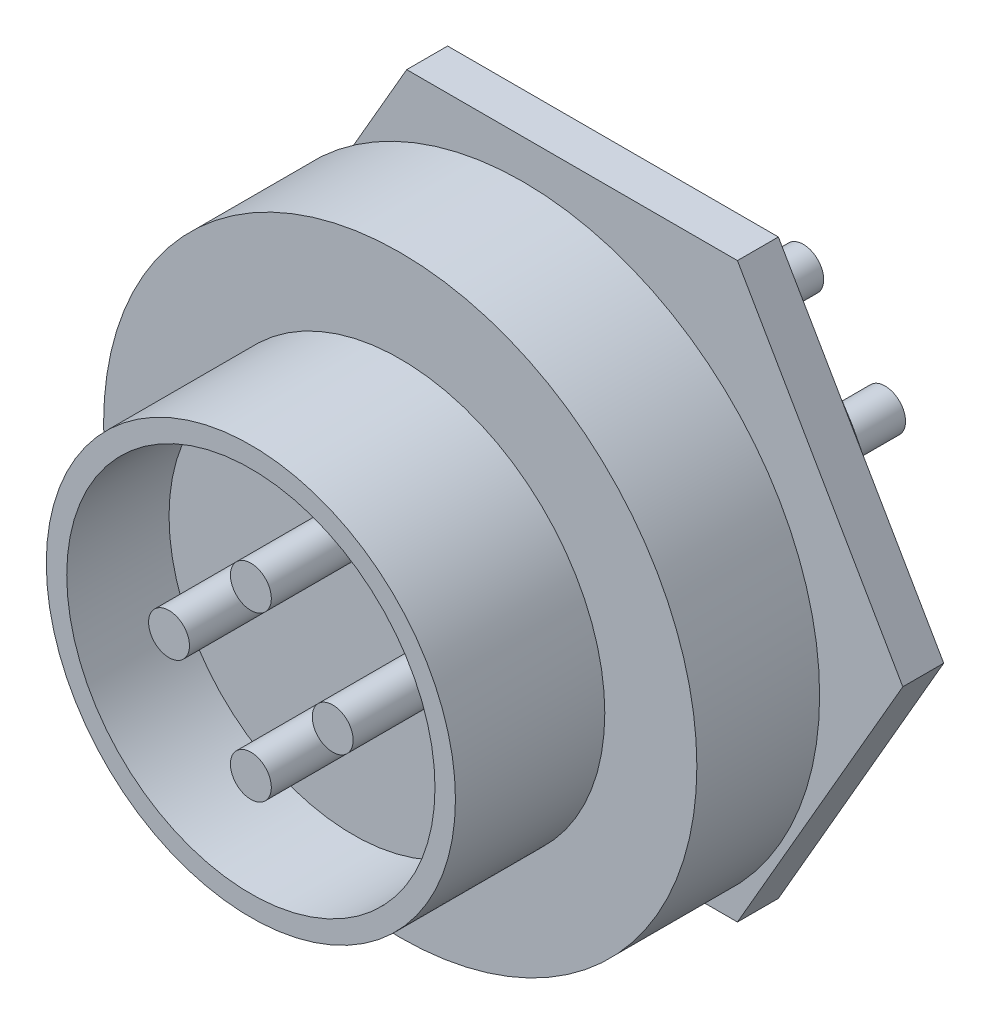
ISO-10303-21;
HEADER;
FILE_DESCRIPTION(('STEP AP214'),'2;1');
FILE_NAME('part.step','',(''),(''),'','','');
FILE_SCHEMA(('AUTOMOTIVE_DESIGN { 1 0 10303 214 1 1 1 1 }'));
ENDSEC;
DATA;
#1=APPLICATION_CONTEXT('core data for automotive mechanical design processes');
#2=APPLICATION_PROTOCOL_DEFINITION('international standard','automotive_design',2000,#1);
#3=PRODUCT_CONTEXT('',#1,'mechanical');
#4=PRODUCT('Part','Part','',(#3));
#5=PRODUCT_RELATED_PRODUCT_CATEGORY('part','',(#4));
#6=PRODUCT_DEFINITION_FORMATION('','',#4);
#7=PRODUCT_DEFINITION_CONTEXT('part definition',#1,'design');
#8=PRODUCT_DEFINITION('design','',#6,#7);
#9=PRODUCT_DEFINITION_SHAPE('','',#8);
#10=(LENGTH_UNIT() NAMED_UNIT(*) SI_UNIT(.MILLI.,.METRE.));
#11=(NAMED_UNIT(*) PLANE_ANGLE_UNIT() SI_UNIT($,.RADIAN.));
#12=(NAMED_UNIT(*) SI_UNIT($,.STERADIAN.) SOLID_ANGLE_UNIT());
#13=UNCERTAINTY_MEASURE_WITH_UNIT(LENGTH_MEASURE(1.E-05),#10,'distance_accuracy_value','');
#14=(GEOMETRIC_REPRESENTATION_CONTEXT(3) GLOBAL_UNCERTAINTY_ASSIGNED_CONTEXT((#13)) GLOBAL_UNIT_ASSIGNED_CONTEXT((#10,
#11,#12)) REPRESENTATION_CONTEXT('',''));
#15=CARTESIAN_POINT('',(0.,0.,0.));
#16=DIRECTION('',(0.,0.,1.));
#17=DIRECTION('',(1.,0.,0.));
#18=AXIS2_PLACEMENT_3D('',#15,#16,#17);
#19=CARTESIAN_POINT('',(0.,0.,2.4));
#20=DIRECTION('',(0.,0.,-1.));
#21=DIRECTION('',(-1.,0.,0.));
#22=AXIS2_PLACEMENT_3D('',#19,#20,#21);
#23=CYLINDRICAL_SURFACE('',#22,10.5);
#24=CARTESIAN_POINT('',(0.,0.,0.));
#25=DIRECTION('',(0.,0.,1.));
#26=DIRECTION('',(1.,0.,0.));
#27=AXIS2_PLACEMENT_3D('',#24,#25,#26);
#28=CIRCLE('',#27,10.5);
#29=CARTESIAN_POINT('',(-4.01995024844836,9.7,0.));
#30=VERTEX_POINT('',#29);
#31=CARTESIAN_POINT('',(4.01995024844836,9.7,0.));
#32=VERTEX_POINT('',#31);
#33=EDGE_CURVE('E167',#30,#32,#28,.T.);
#34=ORIENTED_EDGE('',*,*,#33,.T.);
#35=DIRECTION('',(0.,0.,-1.));
#36=VECTOR('',#35,1.);
#37=CARTESIAN_POINT('',(4.01995024844836,9.7,2.4));
#38=LINE('',#37,#36);
#39=CARTESIAN_POINT('',(4.01995024844836,9.7,2.4));
#40=VERTEX_POINT('',#39);
#41=EDGE_CURVE('E40',#40,#32,#38,.T.);
#42=ORIENTED_EDGE('',*,*,#41,.F.);
#43=CARTESIAN_POINT('',(0.,0.,2.4));
#44=DIRECTION('',(0.,0.,1.));
#45=DIRECTION('',(1.,0.,0.));
#46=AXIS2_PLACEMENT_3D('',#43,#44,#45);
#47=CIRCLE('',#46,10.5);
#48=CARTESIAN_POINT('',(-4.01995024844836,9.7,2.4));
#49=VERTEX_POINT('',#48);
#50=EDGE_CURVE('E170',#49,#40,#47,.T.);
#51=ORIENTED_EDGE('',*,*,#50,.F.);
#52=DIRECTION('',(0.,0.,-1.));
#53=VECTOR('',#52,1.);
#54=CARTESIAN_POINT('',(-4.01995024844836,9.7,2.4));
#55=LINE('',#54,#53);
#56=EDGE_CURVE('E175',#49,#30,#55,.T.);
#57=ORIENTED_EDGE('',*,*,#56,.T.);
#58=EDGE_LOOP('',(#34,#42,#51,#57));
#59=FACE_BOUND('',#58,.T.);
#60=ADVANCED_FACE('F37',(#59),#23,.T.);
#61=CARTESIAN_POINT('',(-4.01995024844836,9.7,2.4));
#62=DIRECTION('',(0.,-1.,0.));
#63=DIRECTION('',(0.,0.,-1.));
#64=AXIS2_PLACEMENT_3D('',#61,#62,#63);
#65=PLANE('',#64);
#66=DIRECTION('',(-1.,0.,0.));
#67=VECTOR('',#66,1.);
#68=CARTESIAN_POINT('',(-4.01995024844836,9.7,0.));
#69=LINE('',#68,#67);
#70=EDGE_CURVE('E173',#32,#30,#69,.T.);
#71=ORIENTED_EDGE('',*,*,#70,.T.);
#72=ORIENTED_EDGE('',*,*,#56,.F.);
#73=DIRECTION('',(-1.,0.,0.));
#74=VECTOR('',#73,1.);
#75=CARTESIAN_POINT('',(-4.01995024844836,9.7,2.4));
#76=LINE('',#75,#74);
#77=EDGE_CURVE('E52',#40,#49,#76,.T.);
#78=ORIENTED_EDGE('',*,*,#77,.F.);
#79=ORIENTED_EDGE('',*,*,#41,.T.);
#80=EDGE_LOOP('',(#71,#72,#78,#79));
#81=FACE_BOUND('',#80,.T.);
#82=ADVANCED_FACE('F181',(#81),#65,.F.);
#83=CARTESIAN_POINT('',(0.,0.,2.4));
#84=DIRECTION('',(0.,0.,1.));
#85=DIRECTION('',(1.,0.,0.));
#86=AXIS2_PLACEMENT_3D('',#83,#84,#85);
#87=PLANE('',#86);
#88=CARTESIAN_POINT('',(0.,0.,2.4));
#89=DIRECTION('',(0.,0.,1.));
#90=DIRECTION('',(1.,0.,0.));
#91=AXIS2_PLACEMENT_3D('',#88,#89,#90);
#92=CIRCLE('',#91,14.5);
#93=CARTESIAN_POINT('',(14.5,0.,2.4));
#94=VERTEX_POINT('',#93);
#95=EDGE_CURVE('E162',#94,#94,#92,.T.);
#96=ORIENTED_EDGE('',*,*,#95,.F.);
#97=EDGE_LOOP('',(#96));
#98=FACE_BOUND('',#97,.T.);
#99=ORIENTED_EDGE('',*,*,#77,.T.);
#100=ORIENTED_EDGE('',*,*,#50,.T.);
#101=EDGE_LOOP('',(#99,#100));
#102=FACE_BOUND('',#101,.T.);
#103=ADVANCED_FACE('F287',(#98,#102),#87,.F.);
#104=CARTESIAN_POINT('',(0.,0.,8.4));
#105=DIRECTION('',(0.,0.,-1.));
#106=DIRECTION('',(-1.,0.,0.));
#107=AXIS2_PLACEMENT_3D('',#104,#105,#106);
#108=CYLINDRICAL_SURFACE('',#107,14.5);
#109=CARTESIAN_POINT('',(0.,0.,8.4));
#110=DIRECTION('',(0.,0.,1.));
#111=DIRECTION('',(1.,0.,0.));
#112=AXIS2_PLACEMENT_3D('',#109,#110,#111);
#113=CIRCLE('',#112,14.5);
#114=CARTESIAN_POINT('',(14.5,0.,8.4));
#115=VERTEX_POINT('',#114);
#116=EDGE_CURVE('E164',#115,#115,#113,.T.);
#117=ORIENTED_EDGE('',*,*,#116,.F.);
#118=EDGE_LOOP('',(#117));
#119=FACE_BOUND('',#118,.T.);
#120=ORIENTED_EDGE('',*,*,#95,.T.);
#121=EDGE_LOOP('',(#120));
#122=FACE_BOUND('',#121,.T.);
#123=ADVANCED_FACE('F291',(#119,#122),#108,.T.);
#124=CARTESIAN_POINT('',(0.,0.,8.4));
#125=DIRECTION('',(0.,0.,1.));
#126=DIRECTION('',(1.,0.,0.));
#127=AXIS2_PLACEMENT_3D('',#124,#125,#126);
#128=PLANE('',#127);
#129=CARTESIAN_POINT('',(0.,0.,8.4));
#130=DIRECTION('',(0.,0.,1.));
#131=DIRECTION('',(1.,0.,0.));
#132=AXIS2_PLACEMENT_3D('',#129,#130,#131);
#133=CIRCLE('',#132,10.);
#134=CARTESIAN_POINT('',(-10.,0.,8.4));
#135=VERTEX_POINT('',#134);
#136=EDGE_CURVE('E12',#135,#135,#133,.T.);
#137=ORIENTED_EDGE('',*,*,#136,.F.);
#138=EDGE_LOOP('',(#137));
#139=FACE_BOUND('',#138,.T.);
#140=ORIENTED_EDGE('',*,*,#116,.T.);
#141=EDGE_LOOP('',(#140));
#142=FACE_BOUND('',#141,.T.);
#143=ADVANCED_FACE('F296',(#139,#142),#128,.T.);
#144=CARTESIAN_POINT('',(0.,0.,15.7));
#145=DIRECTION('',(0.,0.,-1.));
#146=DIRECTION('',(-1.,0.,0.));
#147=AXIS2_PLACEMENT_3D('',#144,#145,#146);
#148=CYLINDRICAL_SURFACE('',#147,10.);
#149=CARTESIAN_POINT('',(0.,0.,15.7));
#150=DIRECTION('',(0.,0.,1.));
#151=DIRECTION('',(1.,0.,0.));
#152=AXIS2_PLACEMENT_3D('',#149,#150,#151);
#153=CIRCLE('',#152,10.);
#154=CARTESIAN_POINT('',(-10.,0.,15.7));
#155=VERTEX_POINT('',#154);
#156=EDGE_CURVE('E158',#155,#155,#153,.T.);
#157=CARTESIAN_POINT('',(-10.,0.,15.7));
#158=CARTESIAN_POINT('',(-10.,0.,15.6239583333333));
#159=CARTESIAN_POINT('',(-10.,0.,15.5479166666667));
#160=CARTESIAN_POINT('',(-10.,0.,15.3958333333333));
#161=CARTESIAN_POINT('',(-10.,0.,15.3197916666667));
#162=CARTESIAN_POINT('',(-10.,0.,15.1677083333333));
#163=CARTESIAN_POINT('',(-10.,0.,15.0916666666667));
#164=CARTESIAN_POINT('',(-10.,0.,14.9395833333333));
#165=CARTESIAN_POINT('',(-10.,0.,14.8635416666667));
#166=CARTESIAN_POINT('',(-10.,0.,14.7114583333333));
#167=CARTESIAN_POINT('',(-10.,0.,14.6354166666667));
#168=CARTESIAN_POINT('',(-10.,0.,14.4833333333333));
#169=CARTESIAN_POINT('',(-10.,0.,14.4072916666667));
#170=CARTESIAN_POINT('',(-10.,0.,14.2552083333333));
#171=CARTESIAN_POINT('',(-10.,0.,14.1791666666667));
#172=CARTESIAN_POINT('',(-10.,0.,14.0270833333333));
#173=CARTESIAN_POINT('',(-10.,0.,13.9510416666667));
#174=CARTESIAN_POINT('',(-10.,0.,13.7989583333333));
#175=CARTESIAN_POINT('',(-10.,0.,13.7229166666667));
#176=CARTESIAN_POINT('',(-10.,0.,13.5708333333333));
#177=CARTESIAN_POINT('',(-10.,0.,13.4947916666667));
#178=CARTESIAN_POINT('',(-10.,0.,13.3427083333333));
#179=CARTESIAN_POINT('',(-10.,0.,13.2666666666667));
#180=CARTESIAN_POINT('',(-10.,0.,13.1145833333333));
#181=CARTESIAN_POINT('',(-10.,0.,13.0385416666667));
#182=CARTESIAN_POINT('',(-10.,0.,12.8864583333333));
#183=CARTESIAN_POINT('',(-10.,0.,12.8104166666667));
#184=CARTESIAN_POINT('',(-10.,0.,12.6583333333333));
#185=CARTESIAN_POINT('',(-10.,0.,12.5822916666667));
#186=CARTESIAN_POINT('',(-10.,0.,12.4302083333333));
#187=CARTESIAN_POINT('',(-10.,0.,12.3541666666667));
#188=CARTESIAN_POINT('',(-10.,0.,12.2020833333333));
#189=CARTESIAN_POINT('',(-10.,0.,12.1260416666667));
#190=CARTESIAN_POINT('',(-10.,0.,11.9739583333333));
#191=CARTESIAN_POINT('',(-10.,0.,11.8979166666667));
#192=CARTESIAN_POINT('',(-10.,0.,11.7458333333333));
#193=CARTESIAN_POINT('',(-10.,0.,11.6697916666667));
#194=CARTESIAN_POINT('',(-10.,0.,11.5177083333333));
#195=CARTESIAN_POINT('',(-10.,0.,11.4416666666667));
#196=CARTESIAN_POINT('',(-10.,0.,11.2895833333333));
#197=CARTESIAN_POINT('',(-10.,0.,11.2135416666667));
#198=CARTESIAN_POINT('',(-10.,0.,11.0614583333333));
#199=CARTESIAN_POINT('',(-10.,0.,10.9854166666667));
#200=CARTESIAN_POINT('',(-10.,0.,10.8333333333333));
#201=CARTESIAN_POINT('',(-10.,0.,10.7572916666667));
#202=CARTESIAN_POINT('',(-10.,0.,10.6052083333333));
#203=CARTESIAN_POINT('',(-10.,0.,10.5291666666667));
#204=CARTESIAN_POINT('',(-10.,0.,10.3770833333333));
#205=CARTESIAN_POINT('',(-10.,0.,10.3010416666667));
#206=CARTESIAN_POINT('',(-10.,0.,10.1489583333333));
#207=CARTESIAN_POINT('',(-10.,0.,10.0729166666667));
#208=CARTESIAN_POINT('',(-10.,0.,9.92083333333333));
#209=CARTESIAN_POINT('',(-10.,0.,9.84479166666667));
#210=CARTESIAN_POINT('',(-10.,0.,9.69270833333333));
#211=CARTESIAN_POINT('',(-10.,0.,9.61666666666667));
#212=CARTESIAN_POINT('',(-10.,0.,9.46458333333333));
#213=CARTESIAN_POINT('',(-10.,0.,9.38854166666667));
#214=CARTESIAN_POINT('',(-10.,0.,9.23645833333333));
#215=CARTESIAN_POINT('',(-10.,0.,9.16041666666667));
#216=CARTESIAN_POINT('',(-10.,0.,9.00833333333333));
#217=CARTESIAN_POINT('',(-10.,0.,8.93229166666667));
#218=CARTESIAN_POINT('',(-10.,0.,8.78020833333333));
#219=CARTESIAN_POINT('',(-10.,0.,8.70416666666667));
#220=CARTESIAN_POINT('',(-10.,0.,8.55208333333333));
#221=CARTESIAN_POINT('',(-10.,0.,8.47604166666667));
#222=CARTESIAN_POINT('',(-10.,0.,8.4));
#223=B_SPLINE_CURVE_WITH_KNOTS('',3,(#157,#158,#159,#160,#161,#162,#163,#164,#165,#166,#167,
#168,#169,#170,#171,#172,#173,#174,#175,#176,#177,#178,#179,#180,#181,#182,#183,#184,#185,#186,
#187,#188,#189,#190,#191,#192,#193,#194,#195,#196,#197,#198,#199,#200,#201,#202,#203,#204,#205,
#206,#207,#208,#209,#210,#211,#212,#213,#214,#215,#216,#217,#218,#219,#220,#221,#222),
.UNSPECIFIED.,.F.,.F.,(4,2,2,2,2,2,2,2,2,2,2,2,2,2,2,2,2,2,2,2,2,2,2,2,2,2,2,2,2,2,2,2,4),(0.,
0.228125000000001,0.456250000000002,0.684375000000001,0.912500000000002,1.140625,1.36875,
1.596875,1.825,2.053125,2.28125,2.509375,2.7375,2.965625,3.19375,3.421875,3.65,3.878125,4.10625,
4.334375,4.5625,4.790625,5.01875,5.246875,5.475,5.703125,5.93125,6.159375,6.3875,6.615625,
6.84375,7.071875,7.3),.UNSPECIFIED.);
#224=EDGE_CURVE('BSEAM301',#155,#135,#223,.T.);
#225=ORIENTED_EDGE('',*,*,#156,.F.);
#226=ORIENTED_EDGE('',*,*,#136,.T.);
#227=ORIENTED_EDGE('',*,*,#224,.T.);
#228=ORIENTED_EDGE('',*,*,#224,.F.);
#229=EDGE_LOOP('',(#225,#227,#226,#228));
#230=FACE_BOUND('',#229,.T.);
#231=ADVANCED_FACE('F301',(#230),#148,.T.);
#232=CARTESIAN_POINT('',(0.,0.,15.7));
#233=DIRECTION('',(0.,0.,1.));
#234=DIRECTION('',(1.,0.,0.));
#235=AXIS2_PLACEMENT_3D('',#232,#233,#234);
#236=PLANE('',#235);
#237=CARTESIAN_POINT('',(0.,0.,15.7));
#238=DIRECTION('',(0.,0.,1.));
#239=DIRECTION('',(1.,0.,0.));
#240=AXIS2_PLACEMENT_3D('',#237,#238,#239);
#241=CIRCLE('',#240,9.);
#242=CARTESIAN_POINT('',(9.,0.,15.7));
#243=VERTEX_POINT('',#242);
#244=EDGE_CURVE('E152',#243,#243,#241,.T.);
#245=ORIENTED_EDGE('',*,*,#244,.F.);
#246=EDGE_LOOP('',(#245));
#247=FACE_BOUND('',#246,.T.);
#248=ORIENTED_EDGE('',*,*,#156,.T.);
#249=EDGE_LOOP('',(#248));
#250=FACE_BOUND('',#249,.T.);
#251=ADVANCED_FACE('F305',(#247,#250),#236,.T.);
#252=CARTESIAN_POINT('',(0.,0.,10.7));
#253=DIRECTION('',(0.,0.,1.));
#254=DIRECTION('',(1.,0.,0.));
#255=AXIS2_PLACEMENT_3D('',#252,#253,#254);
#256=CYLINDRICAL_SURFACE('',#255,9.);
#257=CARTESIAN_POINT('',(0.,0.,10.7));
#258=DIRECTION('',(0.,0.,1.));
#259=DIRECTION('',(1.,0.,0.));
#260=AXIS2_PLACEMENT_3D('',#257,#258,#259);
#261=CIRCLE('',#260,9.);
#262=CARTESIAN_POINT('',(9.,0.,10.7));
#263=VERTEX_POINT('',#262);
#264=EDGE_CURVE('E155',#263,#263,#261,.T.);
#265=ORIENTED_EDGE('',*,*,#264,.F.);
#266=EDGE_LOOP('',(#265));
#267=FACE_BOUND('',#266,.T.);
#268=ORIENTED_EDGE('',*,*,#244,.T.);
#269=EDGE_LOOP('',(#268));
#270=FACE_BOUND('',#269,.T.);
#271=ADVANCED_FACE('F309',(#267,#270),#256,.F.);
#272=CARTESIAN_POINT('',(0.,0.,10.7));
#273=DIRECTION('',(0.,0.,1.));
#274=DIRECTION('',(1.,0.,0.));
#275=AXIS2_PLACEMENT_3D('',#272,#273,#274);
#276=PLANE('',#275);
#277=CARTESIAN_POINT('',(-4.,0.,10.7));
#278=DIRECTION('',(0.,0.,1.));
#279=DIRECTION('',(1.,0.,0.));
#280=AXIS2_PLACEMENT_3D('',#277,#278,#279);
#281=CIRCLE('',#280,1.);
#282=CARTESIAN_POINT('',(-3.,0.,10.7));
#283=VERTEX_POINT('',#282);
#284=EDGE_CURVE('E128',#283,#283,#281,.T.);
#285=ORIENTED_EDGE('',*,*,#284,.F.);
#286=EDGE_LOOP('',(#285));
#287=FACE_BOUND('',#286,.T.);
#288=CARTESIAN_POINT('',(0.,-4.,10.7));
#289=DIRECTION('',(0.,0.,1.));
#290=DIRECTION('',(1.,0.,0.));
#291=AXIS2_PLACEMENT_3D('',#288,#289,#290);
#292=CIRCLE('',#291,1.);
#293=CARTESIAN_POINT('',(0.999999999999999,-4.,10.7));
#294=VERTEX_POINT('',#293);
#295=EDGE_CURVE('E137',#294,#294,#292,.T.);
#296=ORIENTED_EDGE('',*,*,#295,.F.);
#297=EDGE_LOOP('',(#296));
#298=FACE_BOUND('',#297,.T.);
#299=CARTESIAN_POINT('',(4.,0.,10.7));
#300=DIRECTION('',(0.,0.,1.));
#301=DIRECTION('',(1.,0.,0.));
#302=AXIS2_PLACEMENT_3D('',#299,#300,#301);
#303=CIRCLE('',#302,1.);
#304=CARTESIAN_POINT('',(5.,0.,10.7));
#305=VERTEX_POINT('',#304);
#306=EDGE_CURVE('E143',#305,#305,#303,.T.);
#307=ORIENTED_EDGE('',*,*,#306,.F.);
#308=EDGE_LOOP('',(#307));
#309=FACE_BOUND('',#308,.T.);
#310=CARTESIAN_POINT('',(0.,4.,10.7));
#311=DIRECTION('',(0.,0.,1.));
#312=DIRECTION('',(1.,0.,0.));
#313=AXIS2_PLACEMENT_3D('',#310,#311,#312);
#314=CIRCLE('',#313,1.);
#315=CARTESIAN_POINT('',(0.999999999999999,4.,10.7));
#316=VERTEX_POINT('',#315);
#317=EDGE_CURVE('E149',#316,#316,#314,.T.);
#318=ORIENTED_EDGE('',*,*,#317,.F.);
#319=EDGE_LOOP('',(#318));
#320=FACE_BOUND('',#319,.T.);
#321=ORIENTED_EDGE('',*,*,#264,.T.);
#322=EDGE_LOOP('',(#321));
#323=FACE_BOUND('',#322,.T.);
#324=ADVANCED_FACE('F315',(#287,#298,#309,#320,#323),#276,.T.);
#325=CARTESIAN_POINT('',(0.,4.,10.7));
#326=DIRECTION('',(0.,0.,1.));
#327=DIRECTION('',(1.,0.,0.));
#328=AXIS2_PLACEMENT_3D('',#325,#326,#327);
#329=CYLINDRICAL_SURFACE('',#328,1.);
#330=ORIENTED_EDGE('',*,*,#317,.T.);
#331=EDGE_LOOP('',(#330));
#332=FACE_BOUND('',#331,.T.);
#333=CARTESIAN_POINT('',(0.,4.,15.7));
#334=DIRECTION('',(0.,0.,1.));
#335=DIRECTION('',(1.,0.,0.));
#336=AXIS2_PLACEMENT_3D('',#333,#334,#335);
#337=CIRCLE('',#336,1.);
#338=CARTESIAN_POINT('',(0.999999999999999,4.,15.7));
#339=VERTEX_POINT('',#338);
#340=EDGE_CURVE('E146',#339,#339,#337,.T.);
#341=ORIENTED_EDGE('',*,*,#340,.F.);
#342=EDGE_LOOP('',(#341));
#343=FACE_BOUND('',#342,.T.);
#344=ADVANCED_FACE('F319',(#332,#343),#329,.T.);
#345=CARTESIAN_POINT('',(4.,0.,10.7));
#346=DIRECTION('',(0.,0.,1.));
#347=DIRECTION('',(1.,0.,0.));
#348=AXIS2_PLACEMENT_3D('',#345,#346,#347);
#349=CYLINDRICAL_SURFACE('',#348,1.);
#350=ORIENTED_EDGE('',*,*,#306,.T.);
#351=EDGE_LOOP('',(#350));
#352=FACE_BOUND('',#351,.T.);
#353=CARTESIAN_POINT('',(4.,0.,15.7));
#354=DIRECTION('',(0.,0.,1.));
#355=DIRECTION('',(1.,0.,0.));
#356=AXIS2_PLACEMENT_3D('',#353,#354,#355);
#357=CIRCLE('',#356,1.);
#358=CARTESIAN_POINT('',(5.,0.,15.7));
#359=VERTEX_POINT('',#358);
#360=EDGE_CURVE('E140',#359,#359,#357,.T.);
#361=ORIENTED_EDGE('',*,*,#360,.F.);
#362=EDGE_LOOP('',(#361));
#363=FACE_BOUND('',#362,.T.);
#364=ADVANCED_FACE('F323',(#352,#363),#349,.T.);
#365=CARTESIAN_POINT('',(0.,-4.,10.7));
#366=DIRECTION('',(0.,0.,1.));
#367=DIRECTION('',(1.,0.,0.));
#368=AXIS2_PLACEMENT_3D('',#365,#366,#367);
#369=CYLINDRICAL_SURFACE('',#368,1.);
#370=ORIENTED_EDGE('',*,*,#295,.T.);
#371=EDGE_LOOP('',(#370));
#372=FACE_BOUND('',#371,.T.);
#373=CARTESIAN_POINT('',(0.,-4.,15.7));
#374=DIRECTION('',(0.,0.,1.));
#375=DIRECTION('',(1.,0.,0.));
#376=AXIS2_PLACEMENT_3D('',#373,#374,#375);
#377=CIRCLE('',#376,1.);
#378=CARTESIAN_POINT('',(0.999999999999999,-4.,15.7));
#379=VERTEX_POINT('',#378);
#380=EDGE_CURVE('E135',#379,#379,#377,.T.);
#381=ORIENTED_EDGE('',*,*,#380,.F.);
#382=EDGE_LOOP('',(#381));
#383=FACE_BOUND('',#382,.T.);
#384=ADVANCED_FACE('F327',(#372,#383),#369,.T.);
#385=CARTESIAN_POINT('',(-4.,0.,10.7));
#386=DIRECTION('',(0.,0.,1.));
#387=DIRECTION('',(1.,0.,0.));
#388=AXIS2_PLACEMENT_3D('',#385,#386,#387);
#389=CYLINDRICAL_SURFACE('',#388,1.);
#390=ORIENTED_EDGE('',*,*,#284,.T.);
#391=EDGE_LOOP('',(#390));
#392=FACE_BOUND('',#391,.T.);
#393=CARTESIAN_POINT('',(-4.,0.,15.7));
#394=DIRECTION('',(0.,0.,1.));
#395=DIRECTION('',(1.,0.,0.));
#396=AXIS2_PLACEMENT_3D('',#393,#394,#395);
#397=CIRCLE('',#396,1.);
#398=CARTESIAN_POINT('',(-3.,0.,15.7));
#399=VERTEX_POINT('',#398);
#400=EDGE_CURVE('E125',#399,#399,#397,.T.);
#401=ORIENTED_EDGE('',*,*,#400,.F.);
#402=EDGE_LOOP('',(#401));
#403=FACE_BOUND('',#402,.T.);
#404=ADVANCED_FACE('F331',(#392,#403),#389,.T.);
#405=ORIENTED_EDGE('',*,*,#380,.T.);
#406=EDGE_LOOP('',(#405));
#407=FACE_BOUND('',#406,.T.);
#408=ADVANCED_FACE('F335',(#407),#236,.T.);
#409=ORIENTED_EDGE('',*,*,#360,.T.);
#410=EDGE_LOOP('',(#409));
#411=FACE_BOUND('',#410,.T.);
#412=ADVANCED_FACE('F426',(#411),#236,.T.);
#413=ORIENTED_EDGE('',*,*,#340,.T.);
#414=EDGE_LOOP('',(#413));
#415=FACE_BOUND('',#414,.T.);
#416=ADVANCED_FACE('F311',(#415),#236,.T.);
#417=ORIENTED_EDGE('',*,*,#400,.T.);
#418=EDGE_LOOP('',(#417));
#419=FACE_BOUND('',#418,.T.);
#420=ADVANCED_FACE('F312',(#419),#236,.T.);
#421=CARTESIAN_POINT('',(-16.1658075373095,0.,-2.));
#422=DIRECTION('',(0.866025403784439,-0.5,0.));
#423=DIRECTION('',(0.5,0.866025403784438,0.));
#424=AXIS2_PLACEMENT_3D('',#421,#422,#423);
#425=PLANE('',#424);
#426=DIRECTION('',(0.5,0.866025403784438,0.));
#427=VECTOR('',#426,1.);
#428=CARTESIAN_POINT('',(-16.1658075373095,0.,0.));
#429=LINE('',#428,#427);
#430=CARTESIAN_POINT('',(-16.1658075373095,0.,0.));
#431=VERTEX_POINT('',#430);
#432=CARTESIAN_POINT('',(-8.08290376865476,14.,0.));
#433=VERTEX_POINT('',#432);
#434=EDGE_CURVE('E124',#431,#433,#429,.T.);
#435=ORIENTED_EDGE('',*,*,#434,.T.);
#436=DIRECTION('',(0.,0.,1.));
#437=VECTOR('',#436,1.);
#438=CARTESIAN_POINT('',(-8.08290376865476,14.,-2.));
#439=LINE('',#438,#437);
#440=CARTESIAN_POINT('',(-8.08290376865476,14.,-2.));
#441=VERTEX_POINT('',#440);
#442=EDGE_CURVE('E104',#441,#433,#439,.T.);
#443=ORIENTED_EDGE('',*,*,#442,.F.);
#444=DIRECTION('',(0.5,0.866025403784438,0.));
#445=VECTOR('',#444,1.);
#446=CARTESIAN_POINT('',(-16.1658075373095,0.,-2.));
#447=LINE('',#446,#445);
#448=CARTESIAN_POINT('',(-16.1658075373095,0.,-2.));
#449=VERTEX_POINT('',#448);
#450=EDGE_CURVE('E111',#449,#441,#447,.T.);
#451=ORIENTED_EDGE('',*,*,#450,.F.);
#452=DIRECTION('',(0.,0.,1.));
#453=VECTOR('',#452,1.);
#454=CARTESIAN_POINT('',(-16.1658075373095,0.,-2.));
#455=LINE('',#454,#453);
#456=EDGE_CURVE('E208',#449,#431,#455,.T.);
#457=ORIENTED_EDGE('',*,*,#456,.T.);
#458=EDGE_LOOP('',(#435,#443,#451,#457));
#459=FACE_BOUND('',#458,.T.);
#460=ADVANCED_FACE('F122',(#459),#425,.F.);
#461=CARTESIAN_POINT('',(-8.08290376865476,14.,-2.));
#462=DIRECTION('',(0.,-1.,0.));
#463=DIRECTION('',(1.,0.,0.));
#464=AXIS2_PLACEMENT_3D('',#461,#462,#463);
#465=PLANE('',#464);
#466=DIRECTION('',(1.,0.,0.));
#467=VECTOR('',#466,1.);
#468=CARTESIAN_POINT('',(-8.08290376865476,14.,0.));
#469=LINE('',#468,#467);
#470=CARTESIAN_POINT('',(8.08290376865476,14.,0.));
#471=VERTEX_POINT('',#470);
#472=EDGE_CURVE('E191',#433,#471,#469,.T.);
#473=ORIENTED_EDGE('',*,*,#472,.T.);
#474=DIRECTION('',(0.,0.,1.));
#475=VECTOR('',#474,1.);
#476=CARTESIAN_POINT('',(8.08290376865476,14.,-2.));
#477=LINE('',#476,#475);
#478=CARTESIAN_POINT('',(8.08290376865476,14.,-2.));
#479=VERTEX_POINT('',#478);
#480=EDGE_CURVE('E107',#479,#471,#477,.T.);
#481=ORIENTED_EDGE('',*,*,#480,.F.);
#482=DIRECTION('',(1.,0.,0.));
#483=VECTOR('',#482,1.);
#484=CARTESIAN_POINT('',(-8.08290376865476,14.,-2.));
#485=LINE('',#484,#483);
#486=EDGE_CURVE('E100',#441,#479,#485,.T.);
#487=ORIENTED_EDGE('',*,*,#486,.F.);
#488=ORIENTED_EDGE('',*,*,#442,.T.);
#489=EDGE_LOOP('',(#473,#481,#487,#488));
#490=FACE_BOUND('',#489,.T.);
#491=ADVANCED_FACE('F102',(#490),#465,.F.);
#492=CARTESIAN_POINT('',(8.08290376865476,14.,-2.));
#493=DIRECTION('',(-0.866025403784439,-0.5,0.));
#494=DIRECTION('',(0.5,-0.866025403784439,0.));
#495=AXIS2_PLACEMENT_3D('',#492,#493,#494);
#496=PLANE('',#495);
#497=DIRECTION('',(0.5,-0.866025403784439,0.));
#498=VECTOR('',#497,1.);
#499=CARTESIAN_POINT('',(8.08290376865476,14.,0.));
#500=LINE('',#499,#498);
#501=CARTESIAN_POINT('',(16.1658075373095,0.,0.));
#502=VERTEX_POINT('',#501);
#503=EDGE_CURVE('E194',#471,#502,#500,.T.);
#504=ORIENTED_EDGE('',*,*,#503,.T.);
#505=DIRECTION('',(0.,0.,1.));
#506=VECTOR('',#505,1.);
#507=CARTESIAN_POINT('',(16.1658075373095,0.,-2.));
#508=LINE('',#507,#506);
#509=CARTESIAN_POINT('',(16.1658075373095,0.,-2.));
#510=VERTEX_POINT('',#509);
#511=EDGE_CURVE('E130',#510,#502,#508,.T.);
#512=ORIENTED_EDGE('',*,*,#511,.F.);
#513=DIRECTION('',(0.5,-0.866025403784439,0.));
#514=VECTOR('',#513,1.);
#515=CARTESIAN_POINT('',(8.08290376865476,14.,-2.));
#516=LINE('',#515,#514);
#517=EDGE_CURVE('E110',#479,#510,#516,.T.);
#518=ORIENTED_EDGE('',*,*,#517,.F.);
#519=ORIENTED_EDGE('',*,*,#480,.T.);
#520=EDGE_LOOP('',(#504,#512,#518,#519));
#521=FACE_BOUND('',#520,.T.);
#522=ADVANCED_FACE('F341',(#521),#496,.F.);
#523=CARTESIAN_POINT('',(16.1658075373095,0.,-2.));
#524=DIRECTION('',(-0.866025403784438,0.5,0.));
#525=DIRECTION('',(-0.5,-0.866025403784439,0.));
#526=AXIS2_PLACEMENT_3D('',#523,#524,#525);
#527=PLANE('',#526);
#528=DIRECTION('',(-0.5,-0.866025403784439,0.));
#529=VECTOR('',#528,1.);
#530=CARTESIAN_POINT('',(16.1658075373095,0.,0.));
#531=LINE('',#530,#529);
#532=CARTESIAN_POINT('',(8.08290376865475,-14.,0.));
#533=VERTEX_POINT('',#532);
#534=EDGE_CURVE('E203',#502,#533,#531,.T.);
#535=ORIENTED_EDGE('',*,*,#534,.T.);
#536=DIRECTION('',(0.,0.,1.));
#537=VECTOR('',#536,1.);
#538=CARTESIAN_POINT('',(8.08290376865475,-14.,-2.));
#539=LINE('',#538,#537);
#540=CARTESIAN_POINT('',(8.08290376865475,-14.,-2.));
#541=VERTEX_POINT('',#540);
#542=EDGE_CURVE('E213',#541,#533,#539,.T.);
#543=ORIENTED_EDGE('',*,*,#542,.F.);
#544=DIRECTION('',(-0.5,-0.866025403784439,0.));
#545=VECTOR('',#544,1.);
#546=CARTESIAN_POINT('',(16.1658075373095,0.,-2.));
#547=LINE('',#546,#545);
#548=EDGE_CURVE('E222',#510,#541,#547,.T.);
#549=ORIENTED_EDGE('',*,*,#548,.F.);
#550=ORIENTED_EDGE('',*,*,#511,.T.);
#551=EDGE_LOOP('',(#535,#543,#549,#550));
#552=FACE_BOUND('',#551,.T.);
#553=ADVANCED_FACE('F220',(#552),#527,.F.);
#554=CARTESIAN_POINT('',(8.08290376865475,-14.,-2.));
#555=DIRECTION('',(0.,1.,0.));
#556=DIRECTION('',(-1.,0.,0.));
#557=AXIS2_PLACEMENT_3D('',#554,#555,#556);
#558=PLANE('',#557);
#559=DIRECTION('',(-1.,0.,0.));
#560=VECTOR('',#559,1.);
#561=CARTESIAN_POINT('',(8.08290376865475,-14.,0.));
#562=LINE('',#561,#560);
#563=CARTESIAN_POINT('',(-8.08290376865476,-14.,0.));
#564=VERTEX_POINT('',#563);
#565=EDGE_CURVE('E205',#533,#564,#562,.T.);
#566=ORIENTED_EDGE('',*,*,#565,.T.);
#567=DIRECTION('',(0.,0.,1.));
#568=VECTOR('',#567,1.);
#569=CARTESIAN_POINT('',(-8.08290376865476,-14.,-2.));
#570=LINE('',#569,#568);
#571=CARTESIAN_POINT('',(-8.08290376865476,-14.,-2.));
#572=VERTEX_POINT('',#571);
#573=EDGE_CURVE('E210',#572,#564,#570,.T.);
#574=ORIENTED_EDGE('',*,*,#573,.F.);
#575=DIRECTION('',(-1.,0.,0.));
#576=VECTOR('',#575,1.);
#577=CARTESIAN_POINT('',(8.08290376865475,-14.,-2.));
#578=LINE('',#577,#576);
#579=EDGE_CURVE('E230',#541,#572,#578,.T.);
#580=ORIENTED_EDGE('',*,*,#579,.F.);
#581=ORIENTED_EDGE('',*,*,#542,.T.);
#582=EDGE_LOOP('',(#566,#574,#580,#581));
#583=FACE_BOUND('',#582,.T.);
#584=ADVANCED_FACE('F226',(#583),#558,.F.);
#585=CARTESIAN_POINT('',(-8.08290376865476,-14.,-2.));
#586=DIRECTION('',(0.866025403784439,0.5,0.));
#587=DIRECTION('',(-0.5,0.866025403784439,0.));
#588=AXIS2_PLACEMENT_3D('',#585,#586,#587);
#589=PLANE('',#588);
#590=DIRECTION('',(-0.5,0.866025403784439,0.));
#591=VECTOR('',#590,1.);
#592=CARTESIAN_POINT('',(-8.08290376865476,-14.,0.));
#593=LINE('',#592,#591);
#594=EDGE_CURVE('E120',#564,#431,#593,.T.);
#595=ORIENTED_EDGE('',*,*,#594,.T.);
#596=ORIENTED_EDGE('',*,*,#456,.F.);
#597=DIRECTION('',(-0.5,0.866025403784439,0.));
#598=VECTOR('',#597,1.);
#599=CARTESIAN_POINT('',(-8.08290376865476,-14.,-2.));
#600=LINE('',#599,#598);
#601=EDGE_CURVE('E116',#572,#449,#600,.T.);
#602=ORIENTED_EDGE('',*,*,#601,.F.);
#603=ORIENTED_EDGE('',*,*,#573,.T.);
#604=EDGE_LOOP('',(#595,#596,#602,#603));
#605=FACE_BOUND('',#604,.T.);
#606=ADVANCED_FACE('F229',(#605),#589,.F.);
#607=CARTESIAN_POINT('',(0.,0.,-2.));
#608=DIRECTION('',(0.,0.,-1.));
#609=DIRECTION('',(-1.,0.,0.));
#610=AXIS2_PLACEMENT_3D('',#607,#608,#609);
#611=PLANE('',#610);
#612=CARTESIAN_POINT('',(0.,0.,-2.));
#613=DIRECTION('',(0.,0.,-1.));
#614=DIRECTION('',(-1.,0.,0.));
#615=AXIS2_PLACEMENT_3D('',#612,#613,#614);
#616=CIRCLE('',#615,10.5);
#617=CARTESIAN_POINT('',(-10.5,0.,-2.));
#618=VERTEX_POINT('',#617);
#619=EDGE_CURVE('E192',#618,#618,#616,.F.);
#620=ORIENTED_EDGE('',*,*,#619,.T.);
#621=EDGE_LOOP('',(#620));
#622=FACE_BOUND('',#621,.T.);
#623=ORIENTED_EDGE('',*,*,#450,.T.);
#624=ORIENTED_EDGE('',*,*,#486,.T.);
#625=ORIENTED_EDGE('',*,*,#517,.T.);
#626=ORIENTED_EDGE('',*,*,#548,.T.);
#627=ORIENTED_EDGE('',*,*,#579,.T.);
#628=ORIENTED_EDGE('',*,*,#601,.T.);
#629=EDGE_LOOP('',(#623,#624,#625,#626,#627,#628));
#630=FACE_BOUND('',#629,.T.);
#631=ADVANCED_FACE('F114',(#622,#630),#611,.T.);
#632=CARTESIAN_POINT('',(0.,0.,0.));
#633=DIRECTION('',(0.,0.,-1.));
#634=DIRECTION('',(-1.,0.,0.));
#635=AXIS2_PLACEMENT_3D('',#632,#633,#634);
#636=PLANE('',#635);
#637=ORIENTED_EDGE('',*,*,#33,.F.);
#638=ORIENTED_EDGE('',*,*,#70,.F.);
#639=EDGE_LOOP('',(#637,#638));
#640=FACE_BOUND('',#639,.T.);
#641=ORIENTED_EDGE('',*,*,#434,.F.);
#642=ORIENTED_EDGE('',*,*,#594,.F.);
#643=ORIENTED_EDGE('',*,*,#565,.F.);
#644=ORIENTED_EDGE('',*,*,#534,.F.);
#645=ORIENTED_EDGE('',*,*,#503,.F.);
#646=ORIENTED_EDGE('',*,*,#472,.F.);
#647=EDGE_LOOP('',(#641,#642,#643,#644,#645,#646));
#648=FACE_BOUND('',#647,.T.);
#649=ADVANCED_FACE('F183',(#640,#648),#636,.F.);
#650=CARTESIAN_POINT('',(0.,0.,27.698484809835));
#651=DIRECTION('',(0.,0.,-1.));
#652=DIRECTION('',(-1.,0.,0.));
#653=AXIS2_PLACEMENT_3D('',#650,#651,#652);
#654=CYLINDRICAL_SURFACE('',#653,10.5);
#655=ORIENTED_EDGE('',*,*,#619,.F.);
#656=EDGE_LOOP('',(#655));
#657=FACE_BOUND('',#656,.T.);
#658=CARTESIAN_POINT('',(0.,0.,-4.6));
#659=DIRECTION('',(0.,0.,-1.));
#660=DIRECTION('',(-1.,0.,0.));
#661=AXIS2_PLACEMENT_3D('',#658,#659,#660);
#662=CIRCLE('',#661,10.5);
#663=CARTESIAN_POINT('',(-10.5,0.,-4.6));
#664=VERTEX_POINT('',#663);
#665=EDGE_CURVE('E197',#664,#664,#662,.T.);
#666=ORIENTED_EDGE('',*,*,#665,.F.);
#667=EDGE_LOOP('',(#666));
#668=FACE_BOUND('',#667,.T.);
#669=ADVANCED_FACE('F186',(#657,#668),#654,.T.);
#670=CARTESIAN_POINT('',(0.,0.,-4.6));
#671=DIRECTION('',(0.,0.,-1.));
#672=DIRECTION('',(-1.,0.,0.));
#673=AXIS2_PLACEMENT_3D('',#670,#671,#672);
#674=PLANE('',#673);
#675=CARTESIAN_POINT('',(4.,0.,-4.6));
#676=DIRECTION('',(0.,0.,-1.));
#677=DIRECTION('',(-1.,0.,0.));
#678=AXIS2_PLACEMENT_3D('',#675,#676,#677);
#679=CIRCLE('',#678,1.);
#680=CARTESIAN_POINT('',(3.,0.,-4.6));
#681=VERTEX_POINT('',#680);
#682=EDGE_CURVE('E257',#681,#681,#679,.T.);
#683=ORIENTED_EDGE('',*,*,#682,.F.);
#684=EDGE_LOOP('',(#683));
#685=FACE_BOUND('',#684,.T.);
#686=CARTESIAN_POINT('',(0.,4.,-4.6));
#687=DIRECTION('',(0.,0.,-1.));
#688=DIRECTION('',(-1.,0.,0.));
#689=AXIS2_PLACEMENT_3D('',#686,#687,#688);
#690=CIRCLE('',#689,1.);
#691=CARTESIAN_POINT('',(-1.,4.,-4.6));
#692=VERTEX_POINT('',#691);
#693=EDGE_CURVE('E251',#692,#692,#690,.T.);
#694=ORIENTED_EDGE('',*,*,#693,.F.);
#695=EDGE_LOOP('',(#694));
#696=FACE_BOUND('',#695,.T.);
#697=CARTESIAN_POINT('',(-4.,0.,-4.6));
#698=DIRECTION('',(0.,0.,-1.));
#699=DIRECTION('',(-1.,0.,0.));
#700=AXIS2_PLACEMENT_3D('',#697,#698,#699);
#701=CIRCLE('',#700,1.);
#702=CARTESIAN_POINT('',(-5.,0.,-4.6));
#703=VERTEX_POINT('',#702);
#704=EDGE_CURVE('E245',#703,#703,#701,.T.);
#705=ORIENTED_EDGE('',*,*,#704,.F.);
#706=EDGE_LOOP('',(#705));
#707=FACE_BOUND('',#706,.T.);
#708=CARTESIAN_POINT('',(0.,-4.,-4.6));
#709=DIRECTION('',(0.,0.,-1.));
#710=DIRECTION('',(-1.,0.,0.));
#711=AXIS2_PLACEMENT_3D('',#708,#709,#710);
#712=CIRCLE('',#711,1.);
#713=CARTESIAN_POINT('',(-1.,-4.,-4.6));
#714=VERTEX_POINT('',#713);
#715=EDGE_CURVE('E239',#714,#714,#712,.T.);
#716=ORIENTED_EDGE('',*,*,#715,.F.);
#717=EDGE_LOOP('',(#716));
#718=FACE_BOUND('',#717,.T.);
#719=ORIENTED_EDGE('',*,*,#665,.T.);
#720=EDGE_LOOP('',(#719));
#721=FACE_BOUND('',#720,.T.);
#722=ADVANCED_FACE('F263',(#685,#696,#707,#718,#721),#674,.T.);
#723=CARTESIAN_POINT('',(0.,-4.,-41.1284271247462));
#724=DIRECTION('',(0.,0.,1.));
#725=DIRECTION('',(1.,0.,0.));
#726=AXIS2_PLACEMENT_3D('',#723,#724,#725);
#727=CYLINDRICAL_SURFACE('',#726,1.);
#728=CARTESIAN_POINT('',(0.,-4.,-11.3));
#729=DIRECTION('',(0.,0.,1.));
#730=DIRECTION('',(1.,0.,0.));
#731=AXIS2_PLACEMENT_3D('',#728,#729,#730);
#732=CIRCLE('',#731,1.);
#733=CARTESIAN_POINT('',(0.999999999999999,-4.,-11.3));
#734=VERTEX_POINT('',#733);
#735=EDGE_CURVE('E236',#734,#734,#732,.T.);
#736=ORIENTED_EDGE('',*,*,#735,.T.);
#737=EDGE_LOOP('',(#736));
#738=FACE_BOUND('',#737,.T.);
#739=ORIENTED_EDGE('',*,*,#715,.T.);
#740=EDGE_LOOP('',(#739));
#741=FACE_BOUND('',#740,.T.);
#742=ADVANCED_FACE('F266',(#738,#741),#727,.T.);
#743=CARTESIAN_POINT('',(0.,0.,-11.3));
#744=DIRECTION('',(0.,0.,1.));
#745=DIRECTION('',(1.,0.,0.));
#746=AXIS2_PLACEMENT_3D('',#743,#744,#745);
#747=PLANE('',#746);
#748=ORIENTED_EDGE('',*,*,#735,.F.);
#749=EDGE_LOOP('',(#748));
#750=FACE_BOUND('',#749,.T.);
#751=ADVANCED_FACE('F555',(#750),#747,.F.);
#752=CARTESIAN_POINT('',(-4.,0.,-41.1284271247462));
#753=DIRECTION('',(0.,0.,1.));
#754=DIRECTION('',(1.,0.,0.));
#755=AXIS2_PLACEMENT_3D('',#752,#753,#754);
#756=CYLINDRICAL_SURFACE('',#755,1.);
#757=CARTESIAN_POINT('',(-4.,0.,-11.3));
#758=DIRECTION('',(0.,0.,1.));
#759=DIRECTION('',(1.,0.,0.));
#760=AXIS2_PLACEMENT_3D('',#757,#758,#759);
#761=CIRCLE('',#760,1.);
#762=CARTESIAN_POINT('',(-3.,0.,-11.3));
#763=VERTEX_POINT('',#762);
#764=EDGE_CURVE('E242',#763,#763,#761,.T.);
#765=ORIENTED_EDGE('',*,*,#764,.T.);
#766=EDGE_LOOP('',(#765));
#767=FACE_BOUND('',#766,.T.);
#768=ORIENTED_EDGE('',*,*,#704,.T.);
#769=EDGE_LOOP('',(#768));
#770=FACE_BOUND('',#769,.T.);
#771=ADVANCED_FACE('F564',(#767,#770),#756,.T.);
#772=CARTESIAN_POINT('',(0.,0.,-11.3));
#773=DIRECTION('',(0.,0.,1.));
#774=DIRECTION('',(1.,0.,0.));
#775=AXIS2_PLACEMENT_3D('',#772,#773,#774);
#776=PLANE('',#775);
#777=ORIENTED_EDGE('',*,*,#764,.F.);
#778=EDGE_LOOP('',(#777));
#779=FACE_BOUND('',#778,.T.);
#780=ADVANCED_FACE('F573',(#779),#776,.F.);
#781=CARTESIAN_POINT('',(0.,4.,-41.1284271247462));
#782=DIRECTION('',(0.,0.,1.));
#783=DIRECTION('',(1.,0.,0.));
#784=AXIS2_PLACEMENT_3D('',#781,#782,#783);
#785=CYLINDRICAL_SURFACE('',#784,1.);
#786=CARTESIAN_POINT('',(0.,4.,-11.3));
#787=DIRECTION('',(0.,0.,1.));
#788=DIRECTION('',(1.,0.,0.));
#789=AXIS2_PLACEMENT_3D('',#786,#787,#788);
#790=CIRCLE('',#789,1.);
#791=CARTESIAN_POINT('',(0.999999999999999,4.,-11.3));
#792=VERTEX_POINT('',#791);
#793=EDGE_CURVE('E248',#792,#792,#790,.T.);
#794=ORIENTED_EDGE('',*,*,#793,.T.);
#795=EDGE_LOOP('',(#794));
#796=FACE_BOUND('',#795,.T.);
#797=ORIENTED_EDGE('',*,*,#693,.T.);
#798=EDGE_LOOP('',(#797));
#799=FACE_BOUND('',#798,.T.);
#800=ADVANCED_FACE('F582',(#796,#799),#785,.T.);
#801=CARTESIAN_POINT('',(0.,0.,-11.3));
#802=DIRECTION('',(0.,0.,1.));
#803=DIRECTION('',(1.,0.,0.));
#804=AXIS2_PLACEMENT_3D('',#801,#802,#803);
#805=PLANE('',#804);
#806=ORIENTED_EDGE('',*,*,#793,.F.);
#807=EDGE_LOOP('',(#806));
#808=FACE_BOUND('',#807,.T.);
#809=ADVANCED_FACE('F591',(#808),#805,.F.);
#810=CARTESIAN_POINT('',(4.,0.,-41.1284271247462));
#811=DIRECTION('',(0.,0.,1.));
#812=DIRECTION('',(1.,0.,0.));
#813=AXIS2_PLACEMENT_3D('',#810,#811,#812);
#814=CYLINDRICAL_SURFACE('',#813,1.);
#815=CARTESIAN_POINT('',(4.,0.,-11.3));
#816=DIRECTION('',(0.,0.,1.));
#817=DIRECTION('',(1.,0.,0.));
#818=AXIS2_PLACEMENT_3D('',#815,#816,#817);
#819=CIRCLE('',#818,1.);
#820=CARTESIAN_POINT('',(5.,0.,-11.3));
#821=VERTEX_POINT('',#820);
#822=EDGE_CURVE('E254',#821,#821,#819,.T.);
#823=ORIENTED_EDGE('',*,*,#822,.T.);
#824=EDGE_LOOP('',(#823));
#825=FACE_BOUND('',#824,.T.);
#826=ORIENTED_EDGE('',*,*,#682,.T.);
#827=EDGE_LOOP('',(#826));
#828=FACE_BOUND('',#827,.T.);
#829=ADVANCED_FACE('F261',(#825,#828),#814,.T.);
#830=CARTESIAN_POINT('',(0.,0.,-11.3));
#831=DIRECTION('',(0.,0.,1.));
#832=DIRECTION('',(1.,0.,0.));
#833=AXIS2_PLACEMENT_3D('',#830,#831,#832);
#834=PLANE('',#833);
#835=ORIENTED_EDGE('',*,*,#822,.F.);
#836=EDGE_LOOP('',(#835));
#837=FACE_BOUND('',#836,.T.);
#838=ADVANCED_FACE('F608',(#837),#834,.F.);
#839=CLOSED_SHELL('',(#60,#82,#103,#123,#143,#231,#251,#271,#324,#344,#364,#384,#404,#408,#412,
#416,#420,#460,#491,#522,#553,#584,#606,#631,#649,#669,#722,#742,#751,#771,#780,#800,#809,#829,#838));
#840=MANIFOLD_SOLID_BREP('B2',#839);
#841=ADVANCED_BREP_SHAPE_REPRESENTATION('',(#18,#840),#14);
#842=SHAPE_DEFINITION_REPRESENTATION(#9,#841);
ENDSEC;
END-ISO-10303-21;
